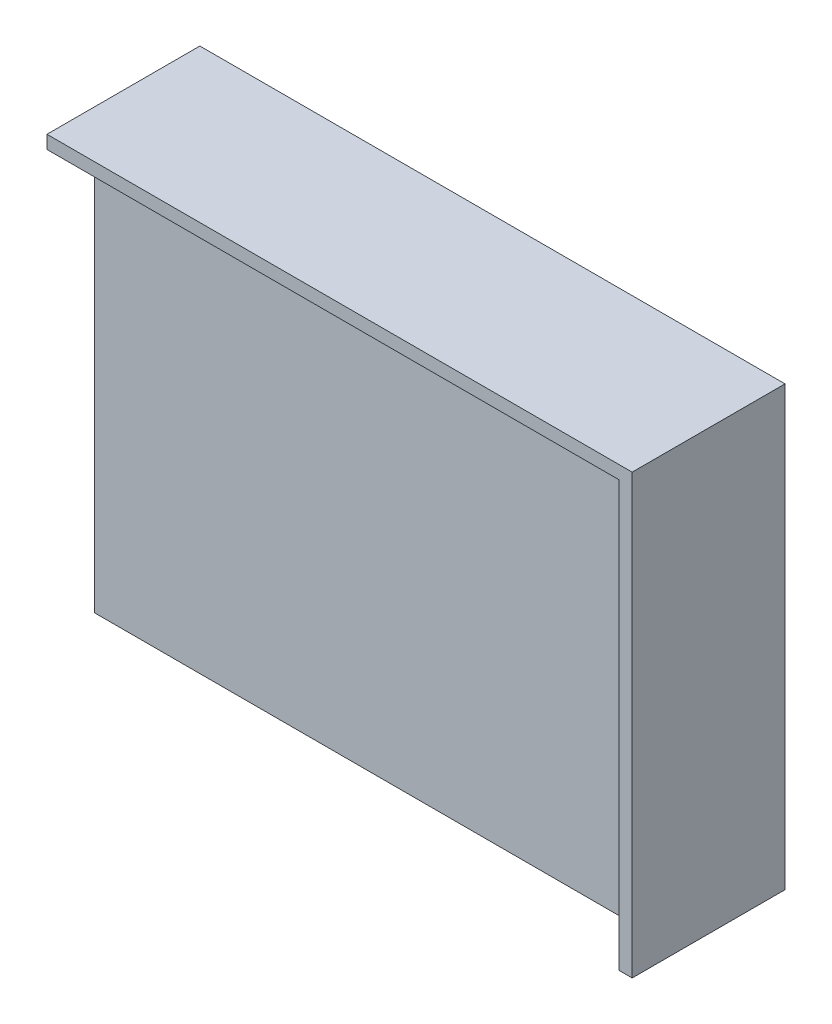
ISO-10303-21;
HEADER;
FILE_DESCRIPTION(('STEP AP214'),'2;1');
FILE_NAME('part.step','',(''),(''),'','','');
FILE_SCHEMA(('AUTOMOTIVE_DESIGN { 1 0 10303 214 1 1 1 1 }'));
ENDSEC;
DATA;
#1=APPLICATION_CONTEXT('core data for automotive mechanical design processes');
#2=APPLICATION_PROTOCOL_DEFINITION('international standard','automotive_design',2000,#1);
#3=PRODUCT_CONTEXT('',#1,'mechanical');
#4=PRODUCT('Part','Part','',(#3));
#5=PRODUCT_RELATED_PRODUCT_CATEGORY('part','',(#4));
#6=PRODUCT_DEFINITION_FORMATION('','',#4);
#7=PRODUCT_DEFINITION_CONTEXT('part definition',#1,'design');
#8=PRODUCT_DEFINITION('design','',#6,#7);
#9=PRODUCT_DEFINITION_SHAPE('','',#8);
#10=(LENGTH_UNIT() NAMED_UNIT(*) SI_UNIT(.MILLI.,.METRE.));
#11=(NAMED_UNIT(*) PLANE_ANGLE_UNIT() SI_UNIT($,.RADIAN.));
#12=(NAMED_UNIT(*) SI_UNIT($,.STERADIAN.) SOLID_ANGLE_UNIT());
#13=UNCERTAINTY_MEASURE_WITH_UNIT(LENGTH_MEASURE(1.E-05),#10,'distance_accuracy_value','');
#14=(GEOMETRIC_REPRESENTATION_CONTEXT(3) GLOBAL_UNCERTAINTY_ASSIGNED_CONTEXT((#13)) GLOBAL_UNIT_ASSIGNED_CONTEXT((#10,
#11,#12)) REPRESENTATION_CONTEXT('',''));
#15=CARTESIAN_POINT('',(0.,0.,0.));
#16=DIRECTION('',(0.,0.,1.));
#17=DIRECTION('',(1.,0.,0.));
#18=AXIS2_PLACEMENT_3D('',#15,#16,#17);
#19=CARTESIAN_POINT('',(72.5968292682926,25.1026341463416,36.83));
#20=DIRECTION('',(0.,-1.,0.));
#21=DIRECTION('',(0.,0.,-1.));
#22=AXIS2_PLACEMENT_3D('',#19,#20,#21);
#23=PLANE('',#22);
#24=DIRECTION('',(0.,0.,1.));
#25=VECTOR('',#24,1.);
#26=CARTESIAN_POINT('',(72.6068292682926,25.1026341463416,36.84));
#27=LINE('',#26,#25);
#28=CARTESIAN_POINT('',(72.6068292682926,25.1026341463416,0.));
#29=VERTEX_POINT('',#28);
#30=CARTESIAN_POINT('',(72.6068292682926,25.1026341463416,25.4));
#31=VERTEX_POINT('',#30);
#32=EDGE_CURVE('E99',#29,#31,#27,.T.);
#33=ORIENTED_EDGE('',*,*,#32,.F.);
#34=DIRECTION('',(1.,0.,0.));
#35=VECTOR('',#34,1.);
#36=CARTESIAN_POINT('',(0.,25.1026341463416,0.));
#37=LINE('',#36,#35);
#38=CARTESIAN_POINT('',(213.576829268293,25.1026341463416,0.));
#39=VERTEX_POINT('',#38);
#40=EDGE_CURVE('E106',#29,#39,#37,.T.);
#41=ORIENTED_EDGE('',*,*,#40,.T.);
#42=DIRECTION('',(0.,0.,-1.));
#43=VECTOR('',#42,1.);
#44=CARTESIAN_POINT('',(213.576829268293,25.1026341463416,28.702));
#45=LINE('',#44,#43);
#46=CARTESIAN_POINT('',(213.576829268293,25.1026341463416,36.83));
#47=VERTEX_POINT('',#46);
#48=EDGE_CURVE('E109',#47,#39,#45,.T.);
#49=ORIENTED_EDGE('',*,*,#48,.F.);
#50=DIRECTION('',(1.,0.,0.));
#51=VECTOR('',#50,1.);
#52=CARTESIAN_POINT('',(213.576829268293,25.1026341463416,36.83));
#53=LINE('',#52,#51);
#54=CARTESIAN_POINT('',(210.401829268293,25.1026341463416,36.83));
#55=VERTEX_POINT('',#54);
#56=EDGE_CURVE('E120',#55,#47,#53,.T.);
#57=ORIENTED_EDGE('',*,*,#56,.F.);
#58=DIRECTION('',(0.,0.,1.));
#59=VECTOR('',#58,1.);
#60=CARTESIAN_POINT('',(210.401829268293,25.1026341463416,0.));
#61=LINE('',#60,#59);
#62=CARTESIAN_POINT('',(210.401829268293,25.1026341463416,25.4));
#63=VERTEX_POINT('',#62);
#64=EDGE_CURVE('E146',#63,#55,#61,.T.);
#65=ORIENTED_EDGE('',*,*,#64,.F.);
#66=DIRECTION('',(1.,0.,0.));
#67=VECTOR('',#66,1.);
#68=CARTESIAN_POINT('',(0.,25.1026341463416,25.4));
#69=LINE('',#68,#67);
#70=EDGE_CURVE('E108',#31,#63,#69,.T.);
#71=ORIENTED_EDGE('',*,*,#70,.F.);
#72=EDGE_LOOP('',(#33,#41,#49,#57,#65,#71));
#73=FACE_BOUND('',#72,.T.);
#74=ADVANCED_FACE('F38',(#73),#23,.T.);
#75=CARTESIAN_POINT('',(72.6068292682926,-97.9603658536585,36.84));
#76=DIRECTION('',(-1.,0.,0.));
#77=DIRECTION('',(0.,-1.,0.));
#78=AXIS2_PLACEMENT_3D('',#75,#76,#77);
#79=PLANE('',#78);
#80=DIRECTION('',(0.,-1.,0.));
#81=VECTOR('',#80,1.);
#82=CARTESIAN_POINT('',(72.6068292682926,0.,0.));
#83=LINE('',#82,#81);
#84=CARTESIAN_POINT('',(72.6068292682926,130.639634146342,0.));
#85=VERTEX_POINT('',#84);
#86=EDGE_CURVE('E11',#85,#29,#83,.T.);
#87=ORIENTED_EDGE('',*,*,#86,.T.);
#88=ORIENTED_EDGE('',*,*,#32,.T.);
#89=DIRECTION('',(0.,-1.,0.));
#90=VECTOR('',#89,1.);
#91=CARTESIAN_POINT('',(72.6068292682926,0.,25.4));
#92=LINE('',#91,#90);
#93=CARTESIAN_POINT('',(72.6068292682926,127.464634146342,25.4));
#94=VERTEX_POINT('',#93);
#95=EDGE_CURVE('E128',#94,#31,#92,.T.);
#96=ORIENTED_EDGE('',*,*,#95,.F.);
#97=DIRECTION('',(0.,0.,-1.));
#98=VECTOR('',#97,1.);
#99=CARTESIAN_POINT('',(72.6068292682926,127.464634146342,0.));
#100=LINE('',#99,#98);
#101=CARTESIAN_POINT('',(72.6068292682926,127.464634146342,36.83));
#102=VERTEX_POINT('',#101);
#103=EDGE_CURVE('E132',#102,#94,#100,.T.);
#104=ORIENTED_EDGE('',*,*,#103,.F.);
#105=DIRECTION('',(0.,-1.,0.));
#106=VECTOR('',#105,1.);
#107=CARTESIAN_POINT('',(72.6068292682926,127.464634146342,36.83));
#108=LINE('',#107,#106);
#109=CARTESIAN_POINT('',(72.6068292682926,130.639634146342,36.83));
#110=VERTEX_POINT('',#109);
#111=EDGE_CURVE('E60',#110,#102,#108,.T.);
#112=ORIENTED_EDGE('',*,*,#111,.F.);
#113=DIRECTION('',(0.,0.,-1.));
#114=VECTOR('',#113,1.);
#115=CARTESIAN_POINT('',(72.6068292682926,130.639634146342,25.4));
#116=LINE('',#115,#114);
#117=EDGE_CURVE('E46',#110,#85,#116,.T.);
#118=ORIENTED_EDGE('',*,*,#117,.T.);
#119=EDGE_LOOP('',(#87,#88,#96,#104,#112,#118));
#120=FACE_BOUND('',#119,.T.);
#121=ADVANCED_FACE('F97',(#120),#79,.T.);
#122=CARTESIAN_POINT('',(213.576829268293,-94.7853658536585,28.702));
#123=DIRECTION('',(1.,0.,0.));
#124=DIRECTION('',(0.,0.,-1.));
#125=AXIS2_PLACEMENT_3D('',#122,#123,#124);
#126=PLANE('',#125);
#127=DIRECTION('',(0.,1.,0.));
#128=VECTOR('',#127,1.);
#129=CARTESIAN_POINT('',(213.576829268293,127.464634146342,36.83));
#130=LINE('',#129,#128);
#131=CARTESIAN_POINT('',(213.576829268293,130.639634146342,36.83));
#132=VERTEX_POINT('',#131);
#133=EDGE_CURVE('E125',#47,#132,#130,.T.);
#134=ORIENTED_EDGE('',*,*,#133,.F.);
#135=ORIENTED_EDGE('',*,*,#48,.T.);
#136=DIRECTION('',(0.,1.,0.));
#137=VECTOR('',#136,1.);
#138=CARTESIAN_POINT('',(213.576829268293,130.639634146342,0.));
#139=LINE('',#138,#137);
#140=CARTESIAN_POINT('',(213.576829268293,130.639634146342,0.));
#141=VERTEX_POINT('',#140);
#142=EDGE_CURVE('E112',#39,#141,#139,.T.);
#143=ORIENTED_EDGE('',*,*,#142,.T.);
#144=DIRECTION('',(0.,0.,-1.));
#145=VECTOR('',#144,1.);
#146=CARTESIAN_POINT('',(213.576829268293,130.639634146342,25.4));
#147=LINE('',#146,#145);
#148=EDGE_CURVE('E137',#132,#141,#147,.T.);
#149=ORIENTED_EDGE('',*,*,#148,.F.);
#150=EDGE_LOOP('',(#134,#135,#143,#149));
#151=FACE_BOUND('',#150,.T.);
#152=ADVANCED_FACE('F150',(#151),#126,.T.);
#153=CARTESIAN_POINT('',(210.401829268293,0.,0.));
#154=DIRECTION('',(-1.,0.,0.));
#155=DIRECTION('',(0.,0.,1.));
#156=AXIS2_PLACEMENT_3D('',#153,#154,#155);
#157=PLANE('',#156);
#158=DIRECTION('',(0.,1.,0.));
#159=VECTOR('',#158,1.);
#160=CARTESIAN_POINT('',(210.401829268293,127.464634146342,25.4));
#161=LINE('',#160,#159);
#162=CARTESIAN_POINT('',(210.401829268293,127.464634146342,25.4));
#163=VERTEX_POINT('',#162);
#164=EDGE_CURVE('E117',#63,#163,#161,.T.);
#165=ORIENTED_EDGE('',*,*,#164,.F.);
#166=ORIENTED_EDGE('',*,*,#64,.T.);
#167=DIRECTION('',(0.,-1.,0.));
#168=VECTOR('',#167,1.);
#169=CARTESIAN_POINT('',(210.401829268293,-80.4343658536585,36.83));
#170=LINE('',#169,#168);
#171=CARTESIAN_POINT('',(210.401829268293,127.464634146342,36.83));
#172=VERTEX_POINT('',#171);
#173=EDGE_CURVE('E121',#172,#55,#170,.T.);
#174=ORIENTED_EDGE('',*,*,#173,.F.);
#175=DIRECTION('',(0.,0.,1.));
#176=VECTOR('',#175,1.);
#177=CARTESIAN_POINT('',(210.401829268293,127.464634146342,36.83));
#178=LINE('',#177,#176);
#179=EDGE_CURVE('E119',#163,#172,#178,.T.);
#180=ORIENTED_EDGE('',*,*,#179,.F.);
#181=EDGE_LOOP('',(#165,#166,#174,#180));
#182=FACE_BOUND('',#181,.T.);
#183=ADVANCED_FACE('F155',(#182),#157,.T.);
#184=CARTESIAN_POINT('',(0.,0.,25.4));
#185=DIRECTION('',(0.,0.,1.));
#186=DIRECTION('',(1.,0.,0.));
#187=AXIS2_PLACEMENT_3D('',#184,#185,#186);
#188=PLANE('',#187);
#189=ORIENTED_EDGE('',*,*,#95,.T.);
#190=ORIENTED_EDGE('',*,*,#70,.T.);
#191=ORIENTED_EDGE('',*,*,#164,.T.);
#192=DIRECTION('',(-1.,0.,0.));
#193=VECTOR('',#192,1.);
#194=CARTESIAN_POINT('',(-65.1881707317074,127.464634146342,25.4));
#195=LINE('',#194,#193);
#196=EDGE_CURVE('E159',#163,#94,#195,.T.);
#197=ORIENTED_EDGE('',*,*,#196,.T.);
#198=EDGE_LOOP('',(#189,#190,#191,#197));
#199=FACE_BOUND('',#198,.T.);
#200=ADVANCED_FACE('F40',(#199),#188,.T.);
#201=CARTESIAN_POINT('',(213.576829268293,127.464634146342,36.83));
#202=DIRECTION('',(0.,0.,1.));
#203=DIRECTION('',(1.,0.,0.));
#204=AXIS2_PLACEMENT_3D('',#201,#202,#203);
#205=PLANE('',#204);
#206=ORIENTED_EDGE('',*,*,#173,.T.);
#207=ORIENTED_EDGE('',*,*,#56,.T.);
#208=ORIENTED_EDGE('',*,*,#133,.T.);
#209=DIRECTION('',(1.,0.,0.));
#210=VECTOR('',#209,1.);
#211=CARTESIAN_POINT('',(213.576829268293,130.639634146342,36.83));
#212=LINE('',#211,#210);
#213=EDGE_CURVE('E124',#110,#132,#212,.T.);
#214=ORIENTED_EDGE('',*,*,#213,.F.);
#215=ORIENTED_EDGE('',*,*,#111,.T.);
#216=DIRECTION('',(1.,0.,0.));
#217=VECTOR('',#216,1.);
#218=CARTESIAN_POINT('',(213.576829268293,127.464634146342,36.83));
#219=LINE('',#218,#217);
#220=EDGE_CURVE('E127',#102,#172,#219,.T.);
#221=ORIENTED_EDGE('',*,*,#220,.T.);
#222=EDGE_LOOP('',(#206,#207,#208,#214,#215,#221));
#223=FACE_BOUND('',#222,.T.);
#224=ADVANCED_FACE('F157',(#223),#205,.T.);
#225=CARTESIAN_POINT('',(0.,0.,0.));
#226=DIRECTION('',(0.,0.,1.));
#227=DIRECTION('',(1.,0.,0.));
#228=AXIS2_PLACEMENT_3D('',#225,#226,#227);
#229=PLANE('',#228);
#230=ORIENTED_EDGE('',*,*,#40,.F.);
#231=ORIENTED_EDGE('',*,*,#86,.F.);
#232=DIRECTION('',(-1.,0.,0.));
#233=VECTOR('',#232,1.);
#234=CARTESIAN_POINT('',(-68.3631707317074,130.639634146342,0.));
#235=LINE('',#234,#233);
#236=EDGE_CURVE('E53',#141,#85,#235,.T.);
#237=ORIENTED_EDGE('',*,*,#236,.F.);
#238=ORIENTED_EDGE('',*,*,#142,.F.);
#239=EDGE_LOOP('',(#230,#231,#237,#238));
#240=FACE_BOUND('',#239,.T.);
#241=ADVANCED_FACE('F111',(#240),#229,.F.);
#242=CARTESIAN_POINT('',(-68.3631707317074,130.639634146342,25.4));
#243=DIRECTION('',(0.,-1.,0.));
#244=DIRECTION('',(1.,0.,0.));
#245=AXIS2_PLACEMENT_3D('',#242,#243,#244);
#246=PLANE('',#245);
#247=ORIENTED_EDGE('',*,*,#117,.F.);
#248=ORIENTED_EDGE('',*,*,#213,.T.);
#249=ORIENTED_EDGE('',*,*,#148,.T.);
#250=ORIENTED_EDGE('',*,*,#236,.T.);
#251=EDGE_LOOP('',(#247,#248,#249,#250));
#252=FACE_BOUND('',#251,.T.);
#253=ADVANCED_FACE('F164',(#252),#246,.F.);
#254=CARTESIAN_POINT('',(0.,127.464634146342,0.));
#255=DIRECTION('',(0.,-1.,0.));
#256=DIRECTION('',(1.,0.,0.));
#257=AXIS2_PLACEMENT_3D('',#254,#255,#256);
#258=PLANE('',#257);
#259=ORIENTED_EDGE('',*,*,#220,.F.);
#260=ORIENTED_EDGE('',*,*,#103,.T.);
#261=ORIENTED_EDGE('',*,*,#196,.F.);
#262=ORIENTED_EDGE('',*,*,#179,.T.);
#263=EDGE_LOOP('',(#259,#260,#261,#262));
#264=FACE_BOUND('',#263,.T.);
#265=ADVANCED_FACE('F166',(#264),#258,.T.);
#266=CLOSED_SHELL('',(#74,#121,#152,#183,#200,#224,#241,#253,#265));
#267=MANIFOLD_SOLID_BREP('B2',#266);
#268=ADVANCED_BREP_SHAPE_REPRESENTATION('',(#18,#267),#14);
#269=SHAPE_DEFINITION_REPRESENTATION(#9,#268);
ENDSEC;
END-ISO-10303-21;
